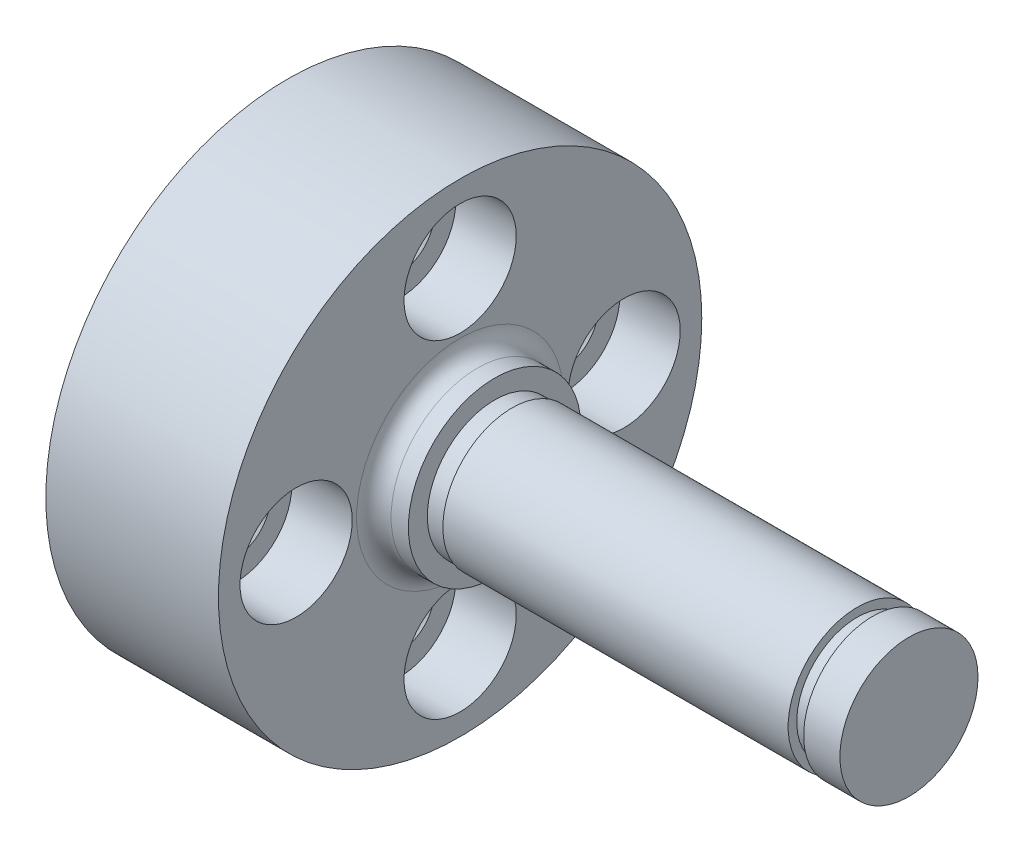
ISO-10303-21;
HEADER;
FILE_DESCRIPTION(('STEP AP214'),'2;1');
FILE_NAME('part.step','',(''),(''),'','','');
FILE_SCHEMA(('AUTOMOTIVE_DESIGN { 1 0 10303 214 1 1 1 1 }'));
ENDSEC;
DATA;
#1=APPLICATION_CONTEXT('core data for automotive mechanical design processes');
#2=APPLICATION_PROTOCOL_DEFINITION('international standard','automotive_design',2000,#1);
#3=PRODUCT_CONTEXT('',#1,'mechanical');
#4=PRODUCT('Part','Part','',(#3));
#5=PRODUCT_RELATED_PRODUCT_CATEGORY('part','',(#4));
#6=PRODUCT_DEFINITION_FORMATION('','',#4);
#7=PRODUCT_DEFINITION_CONTEXT('part definition',#1,'design');
#8=PRODUCT_DEFINITION('design','',#6,#7);
#9=PRODUCT_DEFINITION_SHAPE('','',#8);
#10=(LENGTH_UNIT() NAMED_UNIT(*) SI_UNIT(.MILLI.,.METRE.));
#11=(NAMED_UNIT(*) PLANE_ANGLE_UNIT() SI_UNIT($,.RADIAN.));
#12=(NAMED_UNIT(*) SI_UNIT($,.STERADIAN.) SOLID_ANGLE_UNIT());
#13=UNCERTAINTY_MEASURE_WITH_UNIT(LENGTH_MEASURE(1.E-05),#10,'distance_accuracy_value','');
#14=(GEOMETRIC_REPRESENTATION_CONTEXT(3) GLOBAL_UNCERTAINTY_ASSIGNED_CONTEXT((#13)) GLOBAL_UNIT_ASSIGNED_CONTEXT((#10,
#11,#12)) REPRESENTATION_CONTEXT('',''));
#15=CARTESIAN_POINT('',(0.,0.,0.));
#16=DIRECTION('',(0.,0.,1.));
#17=DIRECTION('',(1.,0.,0.));
#18=AXIS2_PLACEMENT_3D('',#15,#16,#17);
#19=CARTESIAN_POINT('',(6.121,0.,-9.5));
#20=DIRECTION('',(1.,0.,0.));
#21=DIRECTION('',(0.,0.,-1.));
#22=AXIS2_PLACEMENT_3D('',#19,#20,#21);
#23=CONICAL_SURFACE('',#22,1.621,0.7853981634);
#24=CARTESIAN_POINT('',(6.121,0.,-9.5));
#25=DIRECTION('',(1.,0.,0.));
#26=DIRECTION('',(0.,0.,-1.));
#27=AXIS2_PLACEMENT_3D('',#24,#25,#26);
#28=CIRCLE('',#27,1.621);
#29=CARTESIAN_POINT('',(6.121,0.,-11.121));
#30=VERTEX_POINT('',#29);
#31=EDGE_CURVE('E183',#30,#30,#28,.T.);
#32=ORIENTED_EDGE('',*,*,#31,.F.);
#33=EDGE_LOOP('',(#32));
#34=FACE_BOUND('',#33,.T.);
#35=CARTESIAN_POINT('',(6.5,0.,-9.5));
#36=DIRECTION('',(1.,0.,0.));
#37=DIRECTION('',(0.,0.,-1.));
#38=AXIS2_PLACEMENT_3D('',#35,#36,#37);
#39=CIRCLE('',#38,2.);
#40=CARTESIAN_POINT('',(6.5,0.,-11.5));
#41=VERTEX_POINT('',#40);
#42=EDGE_CURVE('E9',#41,#41,#39,.T.);
#43=ORIENTED_EDGE('',*,*,#42,.T.);
#44=EDGE_LOOP('',(#43));
#45=FACE_BOUND('',#44,.T.);
#46=ADVANCED_FACE('F14',(#34,#45),#23,.F.);
#47=CARTESIAN_POINT('',(6.5,0.,-11.5));
#48=DIRECTION('',(1.,0.,0.));
#49=DIRECTION('',(0.,1.,0.));
#50=AXIS2_PLACEMENT_3D('',#47,#48,#49);
#51=PLANE('',#50);
#52=ORIENTED_EDGE('',*,*,#42,.F.);
#53=EDGE_LOOP('',(#52));
#54=FACE_BOUND('',#53,.T.);
#55=CARTESIAN_POINT('',(6.5,0.,-9.5));
#56=DIRECTION('',(1.,0.,0.));
#57=DIRECTION('',(0.,0.,-1.));
#58=AXIS2_PLACEMENT_3D('',#55,#56,#57);
#59=CIRCLE('',#58,3.25);
#60=CARTESIAN_POINT('',(6.5,0.,-12.75));
#61=VERTEX_POINT('',#60);
#62=EDGE_CURVE('E25',#61,#61,#59,.T.);
#63=ORIENTED_EDGE('',*,*,#62,.T.);
#64=EDGE_LOOP('',(#63));
#65=FACE_BOUND('',#64,.T.);
#66=ADVANCED_FACE('F16',(#54,#65),#51,.T.);
#67=CARTESIAN_POINT('',(10.,0.,-9.5));
#68=DIRECTION('',(-1.,0.,0.));
#69=DIRECTION('',(0.,0.,-1.));
#70=AXIS2_PLACEMENT_3D('',#67,#68,#69);
#71=CYLINDRICAL_SURFACE('',#70,3.25);
#72=CARTESIAN_POINT('',(10.,0.,-9.5));
#73=DIRECTION('',(1.,0.,0.));
#74=DIRECTION('',(0.,0.,-1.));
#75=AXIS2_PLACEMENT_3D('',#72,#73,#74);
#76=CIRCLE('',#75,3.25);
#77=CARTESIAN_POINT('',(10.,0.,-12.75));
#78=VERTEX_POINT('',#77);
#79=EDGE_CURVE('E214',#78,#78,#76,.T.);
#80=ORIENTED_EDGE('',*,*,#79,.T.);
#81=EDGE_LOOP('',(#80));
#82=FACE_BOUND('',#81,.T.);
#83=ORIENTED_EDGE('',*,*,#62,.F.);
#84=EDGE_LOOP('',(#83));
#85=FACE_BOUND('',#84,.T.);
#86=ADVANCED_FACE('F336',(#82,#85),#71,.F.);
#87=CARTESIAN_POINT('',(0.,0.,9.5));
#88=DIRECTION('',(-1.,0.,0.));
#89=DIRECTION('',(0.,0.,1.));
#90=AXIS2_PLACEMENT_3D('',#87,#88,#89);
#91=CONICAL_SURFACE('',#90,2.,0.7853981634);
#92=CARTESIAN_POINT('',(0.379,0.,9.5));
#93=DIRECTION('',(1.,0.,0.));
#94=DIRECTION('',(0.,0.,-1.));
#95=AXIS2_PLACEMENT_3D('',#92,#93,#94);
#96=CIRCLE('',#95,1.621);
#97=CARTESIAN_POINT('',(0.379,0.,7.879));
#98=VERTEX_POINT('',#97);
#99=EDGE_CURVE('E165',#98,#98,#96,.T.);
#100=ORIENTED_EDGE('',*,*,#99,.T.);
#101=EDGE_LOOP('',(#100));
#102=FACE_BOUND('',#101,.T.);
#103=CARTESIAN_POINT('',(0.,0.,9.5));
#104=DIRECTION('',(1.,0.,0.));
#105=DIRECTION('',(0.,0.,-1.));
#106=AXIS2_PLACEMENT_3D('',#103,#104,#105);
#107=CIRCLE('',#106,2.);
#108=CARTESIAN_POINT('',(0.,0.,7.5));
#109=VERTEX_POINT('',#108);
#110=EDGE_CURVE('E201',#109,#109,#107,.T.);
#111=ORIENTED_EDGE('',*,*,#110,.F.);
#112=EDGE_LOOP('',(#111));
#113=FACE_BOUND('',#112,.T.);
#114=ADVANCED_FACE('F166',(#102,#113),#91,.F.);
#115=CARTESIAN_POINT('',(10.,0.,9.5));
#116=DIRECTION('',(-1.,0.,0.));
#117=DIRECTION('',(0.,0.,-1.));
#118=AXIS2_PLACEMENT_3D('',#115,#116,#117);
#119=CYLINDRICAL_SURFACE('',#118,1.621);
#120=CARTESIAN_POINT('',(6.121,0.,9.5));
#121=DIRECTION('',(1.,0.,0.));
#122=DIRECTION('',(0.,0.,-1.));
#123=AXIS2_PLACEMENT_3D('',#120,#121,#122);
#124=CIRCLE('',#123,1.621);
#125=CARTESIAN_POINT('',(6.121,0.,7.879));
#126=VERTEX_POINT('',#125);
#127=EDGE_CURVE('E170',#126,#126,#124,.T.);
#128=ORIENTED_EDGE('',*,*,#127,.T.);
#129=EDGE_LOOP('',(#128));
#130=FACE_BOUND('',#129,.T.);
#131=ORIENTED_EDGE('',*,*,#99,.F.);
#132=EDGE_LOOP('',(#131));
#133=FACE_BOUND('',#132,.T.);
#134=ADVANCED_FACE('F423',(#130,#133),#119,.F.);
#135=CARTESIAN_POINT('',(6.121,0.,9.5));
#136=DIRECTION('',(1.,0.,0.));
#137=DIRECTION('',(0.,0.,-1.));
#138=AXIS2_PLACEMENT_3D('',#135,#136,#137);
#139=CONICAL_SURFACE('',#138,1.621,0.7853981634);
#140=ORIENTED_EDGE('',*,*,#127,.F.);
#141=EDGE_LOOP('',(#140));
#142=FACE_BOUND('',#141,.T.);
#143=CARTESIAN_POINT('',(6.5,0.,9.5));
#144=DIRECTION('',(1.,0.,0.));
#145=DIRECTION('',(0.,0.,-1.));
#146=AXIS2_PLACEMENT_3D('',#143,#144,#145);
#147=CIRCLE('',#146,2.);
#148=CARTESIAN_POINT('',(6.5,0.,7.5));
#149=VERTEX_POINT('',#148);
#150=EDGE_CURVE('E178',#149,#149,#147,.T.);
#151=ORIENTED_EDGE('',*,*,#150,.T.);
#152=EDGE_LOOP('',(#151));
#153=FACE_BOUND('',#152,.T.);
#154=ADVANCED_FACE('F495',(#142,#153),#139,.F.);
#155=CARTESIAN_POINT('',(6.5,0.,7.5));
#156=DIRECTION('',(1.,0.,0.));
#157=DIRECTION('',(0.,1.,0.));
#158=AXIS2_PLACEMENT_3D('',#155,#156,#157);
#159=PLANE('',#158);
#160=ORIENTED_EDGE('',*,*,#150,.F.);
#161=EDGE_LOOP('',(#160));
#162=FACE_BOUND('',#161,.T.);
#163=CARTESIAN_POINT('',(6.5,0.,9.5));
#164=DIRECTION('',(1.,0.,0.));
#165=DIRECTION('',(0.,0.,-1.));
#166=AXIS2_PLACEMENT_3D('',#163,#164,#165);
#167=CIRCLE('',#166,3.25);
#168=CARTESIAN_POINT('',(6.5,0.,6.25));
#169=VERTEX_POINT('',#168);
#170=EDGE_CURVE('E271',#169,#169,#167,.T.);
#171=ORIENTED_EDGE('',*,*,#170,.T.);
#172=EDGE_LOOP('',(#171));
#173=FACE_BOUND('',#172,.T.);
#174=ADVANCED_FACE('F621',(#162,#173),#159,.T.);
#175=CARTESIAN_POINT('',(10.,0.,9.5));
#176=DIRECTION('',(-1.,0.,0.));
#177=DIRECTION('',(0.,0.,-1.));
#178=AXIS2_PLACEMENT_3D('',#175,#176,#177);
#179=CYLINDRICAL_SURFACE('',#178,3.25);
#180=CARTESIAN_POINT('',(10.,0.,9.5));
#181=DIRECTION('',(1.,0.,0.));
#182=DIRECTION('',(0.,0.,-1.));
#183=AXIS2_PLACEMENT_3D('',#180,#181,#182);
#184=CIRCLE('',#183,3.25);
#185=CARTESIAN_POINT('',(10.,0.,6.25));
#186=VERTEX_POINT('',#185);
#187=EDGE_CURVE('E211',#186,#186,#184,.T.);
#188=ORIENTED_EDGE('',*,*,#187,.T.);
#189=EDGE_LOOP('',(#188));
#190=FACE_BOUND('',#189,.T.);
#191=ORIENTED_EDGE('',*,*,#170,.F.);
#192=EDGE_LOOP('',(#191));
#193=FACE_BOUND('',#192,.T.);
#194=ADVANCED_FACE('F326',(#190,#193),#179,.F.);
#195=CARTESIAN_POINT('',(0.,-9.5,0.));
#196=DIRECTION('',(-1.,0.,0.));
#197=DIRECTION('',(0.,0.,1.));
#198=AXIS2_PLACEMENT_3D('',#195,#196,#197);
#199=CONICAL_SURFACE('',#198,2.,0.7853981634);
#200=CARTESIAN_POINT('',(0.379,-9.5,0.));
#201=DIRECTION('',(1.,0.,0.));
#202=DIRECTION('',(0.,0.,-1.));
#203=AXIS2_PLACEMENT_3D('',#200,#201,#202);
#204=CIRCLE('',#203,1.621);
#205=CARTESIAN_POINT('',(0.379,-9.5,-1.621));
#206=VERTEX_POINT('',#205);
#207=EDGE_CURVE('E258',#206,#206,#204,.T.);
#208=ORIENTED_EDGE('',*,*,#207,.T.);
#209=EDGE_LOOP('',(#208));
#210=FACE_BOUND('',#209,.T.);
#211=CARTESIAN_POINT('',(0.,-9.5,0.));
#212=DIRECTION('',(1.,0.,0.));
#213=DIRECTION('',(0.,0.,-1.));
#214=AXIS2_PLACEMENT_3D('',#211,#212,#213);
#215=CIRCLE('',#214,2.);
#216=CARTESIAN_POINT('',(0.,-9.5,-2.));
#217=VERTEX_POINT('',#216);
#218=EDGE_CURVE('E295',#217,#217,#215,.T.);
#219=ORIENTED_EDGE('',*,*,#218,.F.);
#220=EDGE_LOOP('',(#219));
#221=FACE_BOUND('',#220,.T.);
#222=ADVANCED_FACE('F308',(#210,#221),#199,.F.);
#223=CARTESIAN_POINT('',(10.,-9.5,0.));
#224=DIRECTION('',(-1.,0.,0.));
#225=DIRECTION('',(0.,0.,-1.));
#226=AXIS2_PLACEMENT_3D('',#223,#224,#225);
#227=CYLINDRICAL_SURFACE('',#226,1.621);
#228=CARTESIAN_POINT('',(6.121,-9.5,0.));
#229=DIRECTION('',(1.,0.,0.));
#230=DIRECTION('',(0.,0.,-1.));
#231=AXIS2_PLACEMENT_3D('',#228,#229,#230);
#232=CIRCLE('',#231,1.621);
#233=CARTESIAN_POINT('',(6.121,-9.5,-1.621));
#234=VERTEX_POINT('',#233);
#235=EDGE_CURVE('E255',#234,#234,#232,.T.);
#236=ORIENTED_EDGE('',*,*,#235,.T.);
#237=EDGE_LOOP('',(#236));
#238=FACE_BOUND('',#237,.T.);
#239=ORIENTED_EDGE('',*,*,#207,.F.);
#240=EDGE_LOOP('',(#239));
#241=FACE_BOUND('',#240,.T.);
#242=ADVANCED_FACE('F313',(#238,#241),#227,.F.);
#243=CARTESIAN_POINT('',(6.121,-9.5,0.));
#244=DIRECTION('',(1.,0.,0.));
#245=DIRECTION('',(0.,0.,-1.));
#246=AXIS2_PLACEMENT_3D('',#243,#244,#245);
#247=CONICAL_SURFACE('',#246,1.621,0.7853981634);
#248=ORIENTED_EDGE('',*,*,#235,.F.);
#249=EDGE_LOOP('',(#248));
#250=FACE_BOUND('',#249,.T.);
#251=CARTESIAN_POINT('',(6.5,-9.5,0.));
#252=DIRECTION('',(1.,0.,0.));
#253=DIRECTION('',(0.,0.,-1.));
#254=AXIS2_PLACEMENT_3D('',#251,#252,#253);
#255=CIRCLE('',#254,2.);
#256=CARTESIAN_POINT('',(6.5,-9.5,-2.));
#257=VERTEX_POINT('',#256);
#258=EDGE_CURVE('E259',#257,#257,#255,.T.);
#259=ORIENTED_EDGE('',*,*,#258,.T.);
#260=EDGE_LOOP('',(#259));
#261=FACE_BOUND('',#260,.T.);
#262=ADVANCED_FACE('F315',(#250,#261),#247,.F.);
#263=CARTESIAN_POINT('',(6.5,-7.5,0.));
#264=DIRECTION('',(1.,0.,0.));
#265=DIRECTION('',(0.,1.,0.));
#266=AXIS2_PLACEMENT_3D('',#263,#264,#265);
#267=PLANE('',#266);
#268=ORIENTED_EDGE('',*,*,#258,.F.);
#269=EDGE_LOOP('',(#268));
#270=FACE_BOUND('',#269,.T.);
#271=CARTESIAN_POINT('',(6.5,-9.5,0.));
#272=DIRECTION('',(1.,0.,0.));
#273=DIRECTION('',(0.,0.,-1.));
#274=AXIS2_PLACEMENT_3D('',#271,#272,#273);
#275=CIRCLE('',#274,3.25);
#276=CARTESIAN_POINT('',(6.5,-9.5,-3.25));
#277=VERTEX_POINT('',#276);
#278=EDGE_CURVE('E181',#277,#277,#275,.T.);
#279=ORIENTED_EDGE('',*,*,#278,.T.);
#280=EDGE_LOOP('',(#279));
#281=FACE_BOUND('',#280,.T.);
#282=ADVANCED_FACE('F323',(#270,#281),#267,.T.);
#283=CARTESIAN_POINT('',(10.,-9.5,0.));
#284=DIRECTION('',(-1.,0.,0.));
#285=DIRECTION('',(0.,0.,-1.));
#286=AXIS2_PLACEMENT_3D('',#283,#284,#285);
#287=CYLINDRICAL_SURFACE('',#286,3.25);
#288=CARTESIAN_POINT('',(10.,-9.5,0.));
#289=DIRECTION('',(1.,0.,0.));
#290=DIRECTION('',(0.,0.,-1.));
#291=AXIS2_PLACEMENT_3D('',#288,#289,#290);
#292=CIRCLE('',#291,3.25);
#293=CARTESIAN_POINT('',(10.,-9.5,-3.25));
#294=VERTEX_POINT('',#293);
#295=EDGE_CURVE('E208',#294,#294,#292,.T.);
#296=ORIENTED_EDGE('',*,*,#295,.T.);
#297=EDGE_LOOP('',(#296));
#298=FACE_BOUND('',#297,.T.);
#299=ORIENTED_EDGE('',*,*,#278,.F.);
#300=EDGE_LOOP('',(#299));
#301=FACE_BOUND('',#300,.T.);
#302=ADVANCED_FACE('F221',(#298,#301),#287,.F.);
#303=CARTESIAN_POINT('',(13.,3.9,0.));
#304=DIRECTION('',(1.,0.,0.));
#305=DIRECTION('',(0.,1.,0.));
#306=AXIS2_PLACEMENT_3D('',#303,#304,#305);
#307=PLANE('',#306);
#308=CARTESIAN_POINT('',(13.,0.,0.));
#309=DIRECTION('',(1.,0.,0.));
#310=DIRECTION('',(0.,0.,-1.));
#311=AXIS2_PLACEMENT_3D('',#308,#309,#310);
#312=CIRCLE('',#311,3.9);
#313=CARTESIAN_POINT('',(13.,0.,-3.9));
#314=VERTEX_POINT('',#313);
#315=EDGE_CURVE('E270',#314,#314,#312,.T.);
#316=ORIENTED_EDGE('',*,*,#315,.T.);
#317=EDGE_LOOP('',(#316));
#318=FACE_BOUND('',#317,.T.);
#319=CARTESIAN_POINT('',(13.,0.,0.));
#320=DIRECTION('',(1.,0.,0.));
#321=DIRECTION('',(0.,0.,-1.));
#322=AXIS2_PLACEMENT_3D('',#319,#320,#321);
#323=CIRCLE('',#322,4.);
#324=CARTESIAN_POINT('',(13.,0.,-4.));
#325=VERTEX_POINT('',#324);
#326=EDGE_CURVE('E294',#325,#325,#323,.T.);
#327=ORIENTED_EDGE('',*,*,#326,.F.);
#328=EDGE_LOOP('',(#327));
#329=FACE_BOUND('',#328,.T.);
#330=ADVANCED_FACE('F344',(#318,#329),#307,.F.);
#331=CARTESIAN_POINT('',(36.,0.,0.));
#332=DIRECTION('',(-1.,0.,0.));
#333=DIRECTION('',(0.,0.,-1.));
#334=AXIS2_PLACEMENT_3D('',#331,#332,#333);
#335=CYLINDRICAL_SURFACE('',#334,4.);
#336=CARTESIAN_POINT('',(33.,0.,0.));
#337=DIRECTION('',(1.,0.,0.));
#338=DIRECTION('',(0.,0.,-1.));
#339=AXIS2_PLACEMENT_3D('',#336,#337,#338);
#340=CIRCLE('',#339,4.);
#341=CARTESIAN_POINT('',(33.,0.,-4.));
#342=VERTEX_POINT('',#341);
#343=EDGE_CURVE('E250',#342,#342,#340,.T.);
#344=ORIENTED_EDGE('',*,*,#343,.F.);
#345=EDGE_LOOP('',(#344));
#346=FACE_BOUND('',#345,.T.);
#347=ORIENTED_EDGE('',*,*,#326,.T.);
#348=EDGE_LOOP('',(#347));
#349=FACE_BOUND('',#348,.T.);
#350=ADVANCED_FACE('F340',(#346,#349),#335,.T.);
#351=CARTESIAN_POINT('',(33.,4.,0.));
#352=DIRECTION('',(-1.,0.,0.));
#353=DIRECTION('',(0.,0.,1.));
#354=AXIS2_PLACEMENT_3D('',#351,#352,#353);
#355=PLANE('',#354);
#356=CARTESIAN_POINT('',(33.,0.,0.));
#357=DIRECTION('',(1.,0.,0.));
#358=DIRECTION('',(0.,0.,-1.));
#359=AXIS2_PLACEMENT_3D('',#356,#357,#358);
#360=CIRCLE('',#359,3.5);
#361=CARTESIAN_POINT('',(33.,0.,-3.5));
#362=VERTEX_POINT('',#361);
#363=EDGE_CURVE('E247',#362,#362,#360,.T.);
#364=ORIENTED_EDGE('',*,*,#363,.F.);
#365=EDGE_LOOP('',(#364));
#366=FACE_BOUND('',#365,.T.);
#367=ORIENTED_EDGE('',*,*,#343,.T.);
#368=EDGE_LOOP('',(#367));
#369=FACE_BOUND('',#368,.T.);
#370=ADVANCED_FACE('F357',(#366,#369),#355,.F.);
#371=CARTESIAN_POINT('',(36.,0.,0.));
#372=DIRECTION('',(-1.,0.,0.));
#373=DIRECTION('',(0.,0.,-1.));
#374=AXIS2_PLACEMENT_3D('',#371,#372,#373);
#375=CYLINDRICAL_SURFACE('',#374,3.5);
#376=CARTESIAN_POINT('',(33.9,0.,0.));
#377=DIRECTION('',(1.,0.,0.));
#378=DIRECTION('',(0.,0.,-1.));
#379=AXIS2_PLACEMENT_3D('',#376,#377,#378);
#380=CIRCLE('',#379,3.5);
#381=CARTESIAN_POINT('',(33.9,0.,-3.5));
#382=VERTEX_POINT('',#381);
#383=EDGE_CURVE('E251',#382,#382,#380,.T.);
#384=ORIENTED_EDGE('',*,*,#383,.F.);
#385=EDGE_LOOP('',(#384));
#386=FACE_BOUND('',#385,.T.);
#387=ORIENTED_EDGE('',*,*,#363,.T.);
#388=EDGE_LOOP('',(#387));
#389=FACE_BOUND('',#388,.T.);
#390=ADVANCED_FACE('F360',(#386,#389),#375,.T.);
#391=CARTESIAN_POINT('',(33.9,3.5,0.));
#392=DIRECTION('',(1.,0.,0.));
#393=DIRECTION('',(0.,1.,0.));
#394=AXIS2_PLACEMENT_3D('',#391,#392,#393);
#395=PLANE('',#394);
#396=ORIENTED_EDGE('',*,*,#383,.T.);
#397=EDGE_LOOP('',(#396));
#398=FACE_BOUND('',#397,.T.);
#399=CARTESIAN_POINT('',(33.9,0.,0.));
#400=DIRECTION('',(1.,0.,0.));
#401=DIRECTION('',(0.,0.,-1.));
#402=AXIS2_PLACEMENT_3D('',#399,#400,#401);
#403=CIRCLE('',#402,4.);
#404=CARTESIAN_POINT('',(33.9,0.,-4.));
#405=VERTEX_POINT('',#404);
#406=EDGE_CURVE('E254',#405,#405,#403,.T.);
#407=ORIENTED_EDGE('',*,*,#406,.F.);
#408=EDGE_LOOP('',(#407));
#409=FACE_BOUND('',#408,.T.);
#410=ADVANCED_FACE('F383',(#398,#409),#395,.F.);
#411=CARTESIAN_POINT('',(36.,0.,0.));
#412=DIRECTION('',(-1.,0.,0.));
#413=DIRECTION('',(0.,0.,-1.));
#414=AXIS2_PLACEMENT_3D('',#411,#412,#413);
#415=CYLINDRICAL_SURFACE('',#414,4.);
#416=CARTESIAN_POINT('',(36.,0.,0.));
#417=DIRECTION('',(1.,0.,0.));
#418=DIRECTION('',(0.,0.,-1.));
#419=AXIS2_PLACEMENT_3D('',#416,#417,#418);
#420=CIRCLE('',#419,4.);
#421=CARTESIAN_POINT('',(36.,0.,-4.));
#422=VERTEX_POINT('',#421);
#423=EDGE_CURVE('E276',#422,#422,#420,.T.);
#424=ORIENTED_EDGE('',*,*,#423,.F.);
#425=EDGE_LOOP('',(#424));
#426=FACE_BOUND('',#425,.T.);
#427=ORIENTED_EDGE('',*,*,#406,.T.);
#428=EDGE_LOOP('',(#427));
#429=FACE_BOUND('',#428,.T.);
#430=ADVANCED_FACE('F378',(#426,#429),#415,.T.);
#431=CARTESIAN_POINT('',(36.,4.,0.));
#432=DIRECTION('',(-1.,0.,0.));
#433=DIRECTION('',(0.,0.,1.));
#434=AXIS2_PLACEMENT_3D('',#431,#432,#433);
#435=PLANE('',#434);
#436=ORIENTED_EDGE('',*,*,#423,.T.);
#437=EDGE_LOOP('',(#436));
#438=FACE_BOUND('',#437,.T.);
#439=ADVANCED_FACE('F374',(#438),#435,.F.);
#440=CARTESIAN_POINT('',(0.,9.5,0.));
#441=DIRECTION('',(-1.,0.,0.));
#442=DIRECTION('',(0.,0.,1.));
#443=AXIS2_PLACEMENT_3D('',#440,#441,#442);
#444=CONICAL_SURFACE('',#443,2.,0.7853981634);
#445=CARTESIAN_POINT('',(0.379,9.5,0.));
#446=DIRECTION('',(1.,0.,0.));
#447=DIRECTION('',(0.,0.,-1.));
#448=AXIS2_PLACEMENT_3D('',#445,#446,#447);
#449=CIRCLE('',#448,1.621);
#450=CARTESIAN_POINT('',(0.379,9.5,-1.621));
#451=VERTEX_POINT('',#450);
#452=EDGE_CURVE('E266',#451,#451,#449,.T.);
#453=ORIENTED_EDGE('',*,*,#452,.T.);
#454=EDGE_LOOP('',(#453));
#455=FACE_BOUND('',#454,.T.);
#456=CARTESIAN_POINT('',(0.,9.5,0.));
#457=DIRECTION('',(-1.,0.,0.));
#458=DIRECTION('',(0.,0.,-1.));
#459=AXIS2_PLACEMENT_3D('',#456,#457,#458);
#460=CIRCLE('',#459,2.);
#461=CARTESIAN_POINT('',(0.,9.5,-2.));
#462=VERTEX_POINT('',#461);
#463=EDGE_CURVE('E285',#462,#462,#460,.T.);
#464=ORIENTED_EDGE('',*,*,#463,.T.);
#465=EDGE_LOOP('',(#464));
#466=FACE_BOUND('',#465,.T.);
#467=ADVANCED_FACE('F377',(#455,#466),#444,.F.);
#468=CARTESIAN_POINT('',(10.,9.5,0.));
#469=DIRECTION('',(-1.,0.,0.));
#470=DIRECTION('',(0.,0.,-1.));
#471=AXIS2_PLACEMENT_3D('',#468,#469,#470);
#472=CYLINDRICAL_SURFACE('',#471,1.621);
#473=CARTESIAN_POINT('',(6.121,9.5,0.));
#474=DIRECTION('',(1.,0.,0.));
#475=DIRECTION('',(0.,0.,-1.));
#476=AXIS2_PLACEMENT_3D('',#473,#474,#475);
#477=CIRCLE('',#476,1.621);
#478=CARTESIAN_POINT('',(6.121,9.5,-1.621));
#479=VERTEX_POINT('',#478);
#480=EDGE_CURVE('E216',#479,#479,#477,.T.);
#481=ORIENTED_EDGE('',*,*,#480,.T.);
#482=EDGE_LOOP('',(#481));
#483=FACE_BOUND('',#482,.T.);
#484=ORIENTED_EDGE('',*,*,#452,.F.);
#485=EDGE_LOOP('',(#484));
#486=FACE_BOUND('',#485,.T.);
#487=ADVANCED_FACE('F484',(#483,#486),#472,.F.);
#488=CARTESIAN_POINT('',(6.121,9.5,0.));
#489=DIRECTION('',(1.,0.,0.));
#490=DIRECTION('',(0.,0.,-1.));
#491=AXIS2_PLACEMENT_3D('',#488,#489,#490);
#492=CONICAL_SURFACE('',#491,1.621,0.7853981634);
#493=ORIENTED_EDGE('',*,*,#480,.F.);
#494=EDGE_LOOP('',(#493));
#495=FACE_BOUND('',#494,.T.);
#496=CARTESIAN_POINT('',(6.5,9.5,0.));
#497=DIRECTION('',(1.,0.,0.));
#498=DIRECTION('',(0.,0.,-1.));
#499=AXIS2_PLACEMENT_3D('',#496,#497,#498);
#500=CIRCLE('',#499,2.);
#501=CARTESIAN_POINT('',(6.5,9.5,-2.));
#502=VERTEX_POINT('',#501);
#503=EDGE_CURVE('E191',#502,#502,#500,.T.);
#504=ORIENTED_EDGE('',*,*,#503,.T.);
#505=EDGE_LOOP('',(#504));
#506=FACE_BOUND('',#505,.T.);
#507=ADVANCED_FACE('F372',(#495,#506),#492,.F.);
#508=CARTESIAN_POINT('',(6.5,11.5,0.));
#509=DIRECTION('',(1.,0.,0.));
#510=DIRECTION('',(0.,1.,0.));
#511=AXIS2_PLACEMENT_3D('',#508,#509,#510);
#512=PLANE('',#511);
#513=ORIENTED_EDGE('',*,*,#503,.F.);
#514=EDGE_LOOP('',(#513));
#515=FACE_BOUND('',#514,.T.);
#516=CARTESIAN_POINT('',(6.5,9.5,0.));
#517=DIRECTION('',(1.,0.,0.));
#518=DIRECTION('',(0.,0.,-1.));
#519=AXIS2_PLACEMENT_3D('',#516,#517,#518);
#520=CIRCLE('',#519,3.25);
#521=CARTESIAN_POINT('',(6.5,9.5,-3.25));
#522=VERTEX_POINT('',#521);
#523=EDGE_CURVE('E184',#522,#522,#520,.T.);
#524=ORIENTED_EDGE('',*,*,#523,.T.);
#525=EDGE_LOOP('',(#524));
#526=FACE_BOUND('',#525,.T.);
#527=ADVANCED_FACE('F368',(#515,#526),#512,.T.);
#528=CARTESIAN_POINT('',(10.,9.5,0.));
#529=DIRECTION('',(-1.,0.,0.));
#530=DIRECTION('',(0.,0.,-1.));
#531=AXIS2_PLACEMENT_3D('',#528,#529,#530);
#532=CYLINDRICAL_SURFACE('',#531,3.25);
#533=CARTESIAN_POINT('',(10.,9.5,0.));
#534=DIRECTION('',(1.,0.,0.));
#535=DIRECTION('',(0.,0.,1.));
#536=AXIS2_PLACEMENT_3D('',#533,#534,#535);
#537=CIRCLE('',#536,3.25);
#538=CARTESIAN_POINT('',(10.,9.5,3.25));
#539=VERTEX_POINT('',#538);
#540=EDGE_CURVE('E206',#539,#539,#537,.T.);
#541=ORIENTED_EDGE('',*,*,#540,.T.);
#542=EDGE_LOOP('',(#541));
#543=FACE_BOUND('',#542,.T.);
#544=ORIENTED_EDGE('',*,*,#523,.F.);
#545=EDGE_LOOP('',(#544));
#546=FACE_BOUND('',#545,.T.);
#547=ADVANCED_FACE('F356',(#543,#546),#532,.F.);
#548=CARTESIAN_POINT('',(10.,0.,-9.5));
#549=DIRECTION('',(-1.,0.,0.));
#550=DIRECTION('',(0.,0.,-1.));
#551=AXIS2_PLACEMENT_3D('',#548,#549,#550);
#552=CYLINDRICAL_SURFACE('',#551,1.621);
#553=ORIENTED_EDGE('',*,*,#31,.T.);
#554=EDGE_LOOP('',(#553));
#555=FACE_BOUND('',#554,.T.);
#556=CARTESIAN_POINT('',(0.379,0.,-9.5));
#557=DIRECTION('',(1.,0.,0.));
#558=DIRECTION('',(0.,0.,-1.));
#559=AXIS2_PLACEMENT_3D('',#556,#557,#558);
#560=CIRCLE('',#559,1.621);
#561=CARTESIAN_POINT('',(0.379,0.,-11.121));
#562=VERTEX_POINT('',#561);
#563=EDGE_CURVE('E185',#562,#562,#560,.T.);
#564=ORIENTED_EDGE('',*,*,#563,.F.);
#565=EDGE_LOOP('',(#564));
#566=FACE_BOUND('',#565,.T.);
#567=ADVANCED_FACE('F352',(#555,#566),#552,.F.);
#568=CARTESIAN_POINT('',(0.,0.,-9.5));
#569=DIRECTION('',(-1.,0.,0.));
#570=DIRECTION('',(0.,0.,1.));
#571=AXIS2_PLACEMENT_3D('',#568,#569,#570);
#572=CONICAL_SURFACE('',#571,2.,0.7853981634);
#573=ORIENTED_EDGE('',*,*,#563,.T.);
#574=EDGE_LOOP('',(#573));
#575=FACE_BOUND('',#574,.T.);
#576=CARTESIAN_POINT('',(0.,0.,-9.5));
#577=DIRECTION('',(1.,0.,0.));
#578=DIRECTION('',(0.,0.,-1.));
#579=AXIS2_PLACEMENT_3D('',#576,#577,#578);
#580=CIRCLE('',#579,2.);
#581=CARTESIAN_POINT('',(0.,0.,-11.5));
#582=VERTEX_POINT('',#581);
#583=EDGE_CURVE('E194',#582,#582,#580,.T.);
#584=ORIENTED_EDGE('',*,*,#583,.F.);
#585=EDGE_LOOP('',(#584));
#586=FACE_BOUND('',#585,.T.);
#587=ADVANCED_FACE('F355',(#575,#586),#572,.F.);
#588=CARTESIAN_POINT('',(0.,0.,0.));
#589=DIRECTION('',(1.,0.,0.));
#590=DIRECTION('',(0.,1.,0.));
#591=AXIS2_PLACEMENT_3D('',#588,#589,#590);
#592=PLANE('',#591);
#593=ORIENTED_EDGE('',*,*,#583,.T.);
#594=EDGE_LOOP('',(#593));
#595=FACE_BOUND('',#594,.T.);
#596=ORIENTED_EDGE('',*,*,#110,.T.);
#597=EDGE_LOOP('',(#596));
#598=FACE_BOUND('',#597,.T.);
#599=ORIENTED_EDGE('',*,*,#218,.T.);
#600=EDGE_LOOP('',(#599));
#601=FACE_BOUND('',#600,.T.);
#602=ORIENTED_EDGE('',*,*,#463,.F.);
#603=EDGE_LOOP('',(#602));
#604=FACE_BOUND('',#603,.T.);
#605=CARTESIAN_POINT('',(0.,0.,0.));
#606=DIRECTION('',(1.,0.,0.));
#607=DIRECTION('',(0.,0.,-1.));
#608=AXIS2_PLACEMENT_3D('',#605,#606,#607);
#609=CIRCLE('',#608,14.);
#610=CARTESIAN_POINT('',(0.,0.,-14.));
#611=VERTEX_POINT('',#610);
#612=EDGE_CURVE('E263',#611,#611,#609,.T.);
#613=ORIENTED_EDGE('',*,*,#612,.F.);
#614=EDGE_LOOP('',(#613));
#615=FACE_BOUND('',#614,.T.);
#616=ADVANCED_FACE('F381',(#595,#598,#601,#604,#615),#592,.F.);
#617=CARTESIAN_POINT('',(36.,0.,0.));
#618=DIRECTION('',(-1.,0.,0.));
#619=DIRECTION('',(0.,0.,-1.));
#620=AXIS2_PLACEMENT_3D('',#617,#618,#619);
#621=CYLINDRICAL_SURFACE('',#620,14.);
#622=CARTESIAN_POINT('',(10.,0.,0.));
#623=DIRECTION('',(1.,0.,0.));
#624=DIRECTION('',(0.,0.,-1.));
#625=AXIS2_PLACEMENT_3D('',#622,#623,#624);
#626=CIRCLE('',#625,14.);
#627=CARTESIAN_POINT('',(10.,0.,-14.));
#628=VERTEX_POINT('',#627);
#629=EDGE_CURVE('E209',#628,#628,#626,.T.);
#630=ORIENTED_EDGE('',*,*,#629,.F.);
#631=EDGE_LOOP('',(#630));
#632=FACE_BOUND('',#631,.T.);
#633=ORIENTED_EDGE('',*,*,#612,.T.);
#634=EDGE_LOOP('',(#633));
#635=FACE_BOUND('',#634,.T.);
#636=ADVANCED_FACE('F228',(#632,#635),#621,.T.);
#637=CARTESIAN_POINT('',(10.,14.,0.));
#638=DIRECTION('',(-1.,0.,0.));
#639=DIRECTION('',(0.,0.,1.));
#640=AXIS2_PLACEMENT_3D('',#637,#638,#639);
#641=PLANE('',#640);
#642=ORIENTED_EDGE('',*,*,#79,.F.);
#643=EDGE_LOOP('',(#642));
#644=FACE_BOUND('',#643,.T.);
#645=ORIENTED_EDGE('',*,*,#187,.F.);
#646=EDGE_LOOP('',(#645));
#647=FACE_BOUND('',#646,.T.);
#648=ORIENTED_EDGE('',*,*,#295,.F.);
#649=EDGE_LOOP('',(#648));
#650=FACE_BOUND('',#649,.T.);
#651=ORIENTED_EDGE('',*,*,#540,.F.);
#652=EDGE_LOOP('',(#651));
#653=FACE_BOUND('',#652,.T.);
#654=CARTESIAN_POINT('',(10.,0.,0.));
#655=DIRECTION('',(1.,0.,0.));
#656=DIRECTION('',(0.,0.,-1.));
#657=AXIS2_PLACEMENT_3D('',#654,#655,#656);
#658=CIRCLE('',#657,6.);
#659=CARTESIAN_POINT('',(10.,0.,-6.));
#660=VERTEX_POINT('',#659);
#661=EDGE_CURVE('E235',#660,#660,#658,.T.);
#662=ORIENTED_EDGE('',*,*,#661,.F.);
#663=EDGE_LOOP('',(#662));
#664=FACE_BOUND('',#663,.T.);
#665=ORIENTED_EDGE('',*,*,#629,.T.);
#666=EDGE_LOOP('',(#665));
#667=FACE_BOUND('',#666,.T.);
#668=ADVANCED_FACE('F224',(#644,#647,#650,#653,#664,#667),#641,.F.);
#669=CARTESIAN_POINT('',(11.,0.,0.));
#670=DIRECTION('',(1.,0.,0.));
#671=DIRECTION('',(0.,0.,-1.));
#672=AXIS2_PLACEMENT_3D('',#669,#670,#671);
#673=TOROIDAL_SURFACE('',#672,6.,1.);
#674=CARTESIAN_POINT('',(11.,0.,0.));
#675=DIRECTION('',(1.,0.,0.));
#676=DIRECTION('',(0.,0.,-1.));
#677=AXIS2_PLACEMENT_3D('',#674,#675,#676);
#678=CIRCLE('',#677,5.);
#679=CARTESIAN_POINT('',(11.,0.,-5.));
#680=VERTEX_POINT('',#679);
#681=EDGE_CURVE('E18',#680,#680,#678,.T.);
#682=ORIENTED_EDGE('',*,*,#681,.F.);
#683=EDGE_LOOP('',(#682));
#684=FACE_BOUND('',#683,.T.);
#685=ORIENTED_EDGE('',*,*,#661,.T.);
#686=EDGE_LOOP('',(#685));
#687=FACE_BOUND('',#686,.T.);
#688=ADVANCED_FACE('F227',(#684,#687),#673,.F.);
#689=CARTESIAN_POINT('',(36.,0.,0.));
#690=DIRECTION('',(-1.,0.,0.));
#691=DIRECTION('',(0.,0.,-1.));
#692=AXIS2_PLACEMENT_3D('',#689,#690,#691);
#693=CYLINDRICAL_SURFACE('',#692,5.);
#694=CARTESIAN_POINT('',(12.,0.,0.));
#695=DIRECTION('',(1.,0.,0.));
#696=DIRECTION('',(0.,0.,-1.));
#697=AXIS2_PLACEMENT_3D('',#694,#695,#696);
#698=CIRCLE('',#697,5.);
#699=CARTESIAN_POINT('',(12.,0.,-5.));
#700=VERTEX_POINT('',#699);
#701=EDGE_CURVE('E279',#700,#700,#698,.T.);
#702=ORIENTED_EDGE('',*,*,#701,.F.);
#703=EDGE_LOOP('',(#702));
#704=FACE_BOUND('',#703,.T.);
#705=ORIENTED_EDGE('',*,*,#681,.T.);
#706=EDGE_LOOP('',(#705));
#707=FACE_BOUND('',#706,.T.);
#708=ADVANCED_FACE('F350',(#704,#707),#693,.T.);
#709=CARTESIAN_POINT('',(12.,5.,0.));
#710=DIRECTION('',(-1.,0.,0.));
#711=DIRECTION('',(0.,0.,1.));
#712=AXIS2_PLACEMENT_3D('',#709,#710,#711);
#713=PLANE('',#712);
#714=CARTESIAN_POINT('',(12.,0.,0.));
#715=DIRECTION('',(1.,0.,0.));
#716=DIRECTION('',(0.,0.,-1.));
#717=AXIS2_PLACEMENT_3D('',#714,#715,#716);
#718=CIRCLE('',#717,3.9);
#719=CARTESIAN_POINT('',(12.,0.,-3.9));
#720=VERTEX_POINT('',#719);
#721=EDGE_CURVE('E267',#720,#720,#718,.T.);
#722=ORIENTED_EDGE('',*,*,#721,.F.);
#723=EDGE_LOOP('',(#722));
#724=FACE_BOUND('',#723,.T.);
#725=ORIENTED_EDGE('',*,*,#701,.T.);
#726=EDGE_LOOP('',(#725));
#727=FACE_BOUND('',#726,.T.);
#728=ADVANCED_FACE('F364',(#724,#727),#713,.F.);
#729=CARTESIAN_POINT('',(13.,0.,0.));
#730=DIRECTION('',(-1.,0.,0.));
#731=DIRECTION('',(0.,0.,-1.));
#732=AXIS2_PLACEMENT_3D('',#729,#730,#731);
#733=CYLINDRICAL_SURFACE('',#732,3.9);
#734=ORIENTED_EDGE('',*,*,#315,.F.);
#735=EDGE_LOOP('',(#734));
#736=FACE_BOUND('',#735,.T.);
#737=ORIENTED_EDGE('',*,*,#721,.T.);
#738=EDGE_LOOP('',(#737));
#739=FACE_BOUND('',#738,.T.);
#740=ADVANCED_FACE('F441',(#736,#739),#733,.T.);
#741=CLOSED_SHELL('',(#46,#66,#86,#114,#134,#154,#174,#194,#222,#242,#262,#282,#302,#330,#350,
#370,#390,#410,#430,#439,#467,#487,#507,#527,#547,#567,#587,#616,#636,#668,#688,#708,#728,#740));
#742=MANIFOLD_SOLID_BREP('B1',#741);
#743=ADVANCED_BREP_SHAPE_REPRESENTATION('',(#18,#742),#14);
#744=SHAPE_DEFINITION_REPRESENTATION(#9,#743);
ENDSEC;
END-ISO-10303-21;
